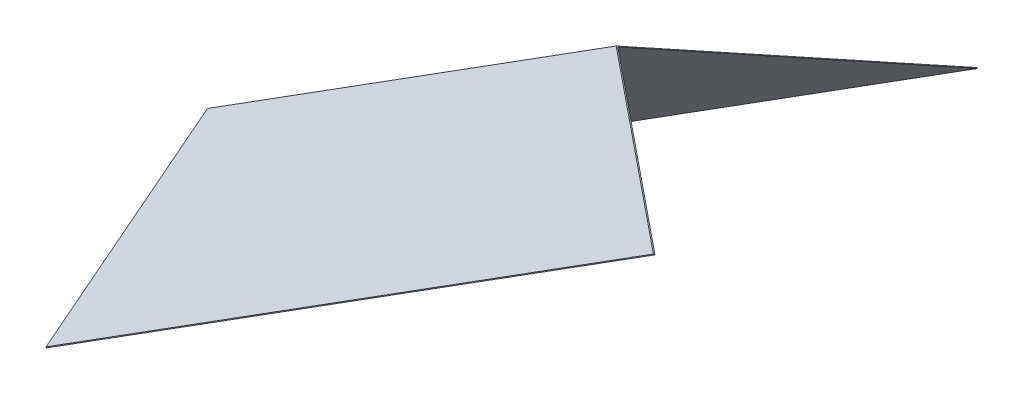
ISO-10303-21;
HEADER;
FILE_DESCRIPTION(('STEP AP214'),'2;1');
FILE_NAME('part.step','',(''),(''),'','','');
FILE_SCHEMA(('AUTOMOTIVE_DESIGN { 1 0 10303 214 1 1 1 1 }'));
ENDSEC;
DATA;
#1=APPLICATION_CONTEXT('core data for automotive mechanical design processes');
#2=APPLICATION_PROTOCOL_DEFINITION('international standard','automotive_design',2000,#1);
#3=PRODUCT_CONTEXT('',#1,'mechanical');
#4=PRODUCT('Part','Part','',(#3));
#5=PRODUCT_RELATED_PRODUCT_CATEGORY('part','',(#4));
#6=PRODUCT_DEFINITION_FORMATION('','',#4);
#7=PRODUCT_DEFINITION_CONTEXT('part definition',#1,'design');
#8=PRODUCT_DEFINITION('design','',#6,#7);
#9=PRODUCT_DEFINITION_SHAPE('','',#8);
#10=(LENGTH_UNIT() NAMED_UNIT(*) SI_UNIT(.MILLI.,.METRE.));
#11=(NAMED_UNIT(*) PLANE_ANGLE_UNIT() SI_UNIT($,.RADIAN.));
#12=(NAMED_UNIT(*) SI_UNIT($,.STERADIAN.) SOLID_ANGLE_UNIT());
#13=UNCERTAINTY_MEASURE_WITH_UNIT(LENGTH_MEASURE(1.E-05),#10,'distance_accuracy_value','');
#14=(GEOMETRIC_REPRESENTATION_CONTEXT(3) GLOBAL_UNCERTAINTY_ASSIGNED_CONTEXT((#13)) GLOBAL_UNIT_ASSIGNED_CONTEXT((#10,
#11,#12)) REPRESENTATION_CONTEXT('',''));
#15=CARTESIAN_POINT('',(0.,0.,0.));
#16=DIRECTION('',(0.,0.,1.));
#17=DIRECTION('',(1.,0.,0.));
#18=AXIS2_PLACEMENT_3D('',#15,#16,#17);
#19=CARTESIAN_POINT('',(-319.512763001159,500.225965029596,-389.338785232194));
#20=DIRECTION('',(-0.446530337817959,0.70609992000595,-0.54957580039133));
#21=DIRECTION('',(0.,0.614210049001455,0.789142582620929));
#22=AXIS2_PLACEMENT_3D('',#19,#20,#21);
#23=PLANE('',#22);
#24=DIRECTION('',(0.84517937784663,0.53448275862069,0.));
#25=VECTOR('',#24,1.);
#26=CARTESIAN_POINT('',(-89.3424576744258,1821.51710603682,1121.2545563695));
#27=LINE('',#26,#25);
#28=CARTESIAN_POINT('',(-86.1674576744245,1823.52494342981,1121.2545563695));
#29=VERTEX_POINT('',#28);
#30=CARTESIAN_POINT('',(1155.77580176923,2608.91710603682,1121.2545563695));
#31=VERTEX_POINT('',#30);
#32=EDGE_CURVE('E40',#29,#31,#27,.T.);
#33=ORIENTED_EDGE('',*,*,#32,.F.);
#34=DIRECTION('',(0.,0.614210049001455,0.789142582620929));
#35=VECTOR('',#34,1.);
#36=CARTESIAN_POINT('',(-86.1674576744258,592.12158959957,-460.863522729798));
#37=LINE('',#36,#35);
#38=CARTESIAN_POINT('',(-86.1674576744252,2080.52812973195,1451.4545563695));
#39=VERTEX_POINT('',#38);
#40=EDGE_CURVE('E92',#29,#39,#37,.T.);
#41=ORIENTED_EDGE('',*,*,#40,.T.);
#42=DIRECTION('',(-0.845179377846631,-0.534482758620689,0.));
#43=VECTOR('',#42,1.);
#44=CARTESIAN_POINT('',(749.375801769231,2608.91710603682,1451.4545563695));
#45=LINE('',#44,#43);
#46=CARTESIAN_POINT('',(749.375801769231,2608.91710603682,1451.4545563695));
#47=VERTEX_POINT('',#46);
#48=EDGE_CURVE('E84',#47,#39,#45,.T.);
#49=ORIENTED_EDGE('',*,*,#48,.F.);
#50=DIRECTION('',(-0.776114000116266,0.,0.630592625094465));
#51=VECTOR('',#50,1.);
#52=CARTESIAN_POINT('',(1155.77580176923,2608.91710603682,1121.2545563695));
#53=LINE('',#52,#51);
#54=EDGE_CURVE('E143',#31,#47,#53,.T.);
#55=ORIENTED_EDGE('',*,*,#54,.F.);
#56=EDGE_LOOP('',(#33,#41,#49,#55));
#57=FACE_BOUND('',#56,.T.);
#58=ADVANCED_FACE('F37',(#57),#23,.T.);
#59=CARTESIAN_POINT('',(-316.337763001159,500.225965029596,-389.338785232194));
#60=DIRECTION('',(-0.446530337817959,0.70609992000595,-0.54957580039133));
#61=DIRECTION('',(0.,0.614210049001455,0.789142582620929));
#62=AXIS2_PLACEMENT_3D('',#59,#60,#61);
#63=PLANE('',#62);
#64=DIRECTION('',(0.,0.614210049001455,0.789142582620929));
#65=VECTOR('',#64,1.);
#66=CARTESIAN_POINT('',(-86.1674576744258,590.871216862904,-459.890325342188));
#67=LINE('',#66,#65);
#68=CARTESIAN_POINT('',(-86.1674576744245,1821.51710603682,1121.2545563695));
#69=VERTEX_POINT('',#68);
#70=CARTESIAN_POINT('',(-86.1674576744253,2078.52029233896,1451.4545563695));
#71=VERTEX_POINT('',#70);
#72=EDGE_CURVE('E115',#69,#71,#67,.T.);
#73=ORIENTED_EDGE('',*,*,#72,.F.);
#74=DIRECTION('',(0.84517937784663,0.53448275862069,0.));
#75=VECTOR('',#74,1.);
#76=CARTESIAN_POINT('',(-86.1674576744258,1821.51710603682,1121.2545563695));
#77=LINE('',#76,#75);
#78=CARTESIAN_POINT('',(1158.95080176923,2608.91710603682,1121.2545563695));
#79=VERTEX_POINT('',#78);
#80=EDGE_CURVE('E47',#69,#79,#77,.T.);
#81=ORIENTED_EDGE('',*,*,#80,.T.);
#82=DIRECTION('',(-0.776114000116266,0.,0.630592625094465));
#83=VECTOR('',#82,1.);
#84=CARTESIAN_POINT('',(1158.95080176923,2608.91710603682,1121.2545563695));
#85=LINE('',#84,#83);
#86=CARTESIAN_POINT('',(752.550801769231,2608.91710603682,1451.4545563695));
#87=VERTEX_POINT('',#86);
#88=EDGE_CURVE('E55',#79,#87,#85,.T.);
#89=ORIENTED_EDGE('',*,*,#88,.T.);
#90=DIRECTION('',(-0.845179377846631,-0.534482758620689,0.));
#91=VECTOR('',#90,1.);
#92=CARTESIAN_POINT('',(752.550801769231,2608.91710603682,1451.4545563695));
#93=LINE('',#92,#91);
#94=EDGE_CURVE('E151',#87,#71,#93,.T.);
#95=ORIENTED_EDGE('',*,*,#94,.T.);
#96=EDGE_LOOP('',(#73,#81,#89,#95));
#97=FACE_BOUND('',#96,.T.);
#98=ADVANCED_FACE('F159',(#97),#63,.F.);
#99=CARTESIAN_POINT('',(-86.1674576744258,1821.51710603682,1121.2545563695));
#100=DIRECTION('',(0.,0.,1.));
#101=DIRECTION('',(0.,-1.,0.));
#102=AXIS2_PLACEMENT_3D('',#99,#100,#101);
#103=PLANE('',#102);
#104=DIRECTION('',(0.,-1.,0.));
#105=VECTOR('',#104,1.);
#106=CARTESIAN_POINT('',(-86.1674576744258,1821.51710603682,1121.2545563695));
#107=LINE('',#106,#105);
#108=EDGE_CURVE('E134',#29,#69,#107,.T.);
#109=ORIENTED_EDGE('',*,*,#108,.F.);
#110=ORIENTED_EDGE('',*,*,#32,.T.);
#111=DIRECTION('',(-1.,0.,0.));
#112=VECTOR('',#111,1.);
#113=CARTESIAN_POINT('',(1158.95080176923,2608.91710603682,1121.2545563695));
#114=LINE('',#113,#112);
#115=EDGE_CURVE('E141',#79,#31,#114,.T.);
#116=ORIENTED_EDGE('',*,*,#115,.F.);
#117=ORIENTED_EDGE('',*,*,#80,.F.);
#118=EDGE_LOOP('',(#109,#110,#116,#117));
#119=FACE_BOUND('',#118,.T.);
#120=ADVANCED_FACE('F178',(#119),#103,.F.);
#121=CARTESIAN_POINT('',(-1031.89324250003,1626.71560523187,1266.11476000002));
#122=DIRECTION('',(-0.446530337817959,0.706099920005952,0.549575800391326));
#123=DIRECTION('',(0.,-0.614210049001451,0.789142582620932));
#124=AXIS2_PLACEMENT_3D('',#121,#122,#123);
#125=PLANE('',#124);
#126=ORIENTED_EDGE('',*,*,#48,.T.);
#127=DIRECTION('',(0.,-0.614210049001451,0.789142582620932));
#128=VECTOR('',#127,1.);
#129=CARTESIAN_POINT('',(-86.1674576744257,1999.15961710856,1555.99755155501));
#130=LINE('',#129,#128);
#131=CARTESIAN_POINT('',(-86.1674576744258,1823.5249434298,1781.65455636951));
#132=VERTEX_POINT('',#131);
#133=EDGE_CURVE('E104',#39,#132,#130,.T.);
#134=ORIENTED_EDGE('',*,*,#133,.T.);
#135=DIRECTION('',(0.84517937784663,0.53448275862069,0.));
#136=VECTOR('',#135,1.);
#137=CARTESIAN_POINT('',(-89.3424576744258,1821.51710603682,1781.65455636951));
#138=LINE('',#137,#136);
#139=CARTESIAN_POINT('',(1155.77580176923,2608.91710603682,1781.6545563695));
#140=VERTEX_POINT('',#139);
#141=EDGE_CURVE('E113',#132,#140,#138,.T.);
#142=ORIENTED_EDGE('',*,*,#141,.T.);
#143=DIRECTION('',(-0.776114000116266,0.,-0.630592625094465));
#144=VECTOR('',#143,1.);
#145=CARTESIAN_POINT('',(1155.77580176923,2608.91710603682,1781.6545563695));
#146=LINE('',#145,#144);
#147=EDGE_CURVE('E132',#140,#47,#146,.T.);
#148=ORIENTED_EDGE('',*,*,#147,.T.);
#149=EDGE_LOOP('',(#126,#134,#142,#148));
#150=FACE_BOUND('',#149,.T.);
#151=ADVANCED_FACE('F111',(#150),#125,.T.);
#152=CARTESIAN_POINT('',(-1028.71824250003,1626.71560523187,1266.11476000002));
#153=DIRECTION('',(-0.446530337817959,0.706099920005952,0.549575800391326));
#154=DIRECTION('',(0.,-0.614210049001451,0.789142582620932));
#155=AXIS2_PLACEMENT_3D('',#152,#153,#154);
#156=PLANE('',#155);
#157=DIRECTION('',(0.,-0.614210049001451,0.789142582620932));
#158=VECTOR('',#157,1.);
#159=CARTESIAN_POINT('',(-86.1674576744258,1997.90924437189,1555.0243541674));
#160=LINE('',#159,#158);
#161=CARTESIAN_POINT('',(-86.1674576744257,1821.51710603682,1781.65455636951));
#162=VERTEX_POINT('',#161);
#163=EDGE_CURVE('E106',#71,#162,#160,.T.);
#164=ORIENTED_EDGE('',*,*,#163,.F.);
#165=ORIENTED_EDGE('',*,*,#94,.F.);
#166=DIRECTION('',(-0.776114000116266,0.,-0.630592625094465));
#167=VECTOR('',#166,1.);
#168=CARTESIAN_POINT('',(1158.95080176923,2608.91710603682,1781.6545563695));
#169=LINE('',#168,#167);
#170=CARTESIAN_POINT('',(1158.95080176923,2608.91710603682,1781.6545563695));
#171=VERTEX_POINT('',#170);
#172=EDGE_CURVE('E72',#171,#87,#169,.T.);
#173=ORIENTED_EDGE('',*,*,#172,.F.);
#174=DIRECTION('',(0.84517937784663,0.53448275862069,0.));
#175=VECTOR('',#174,1.);
#176=CARTESIAN_POINT('',(-86.1674576744258,1821.51710603682,1781.65455636951));
#177=LINE('',#176,#175);
#178=EDGE_CURVE('E120',#162,#171,#177,.T.);
#179=ORIENTED_EDGE('',*,*,#178,.F.);
#180=EDGE_LOOP('',(#164,#165,#173,#179));
#181=FACE_BOUND('',#180,.T.);
#182=ADVANCED_FACE('F161',(#181),#156,.F.);
#183=CARTESIAN_POINT('',(-86.1674576744258,1821.51710603682,1781.65455636951));
#184=DIRECTION('',(0.,0.,1.));
#185=DIRECTION('',(0.,-1.,0.));
#186=AXIS2_PLACEMENT_3D('',#183,#184,#185);
#187=PLANE('',#186);
#188=ORIENTED_EDGE('',*,*,#141,.F.);
#189=DIRECTION('',(0.,-1.,0.));
#190=VECTOR('',#189,1.);
#191=CARTESIAN_POINT('',(-86.1674576744258,1821.51710603682,1781.65455636951));
#192=LINE('',#191,#190);
#193=EDGE_CURVE('E12',#132,#162,#192,.T.);
#194=ORIENTED_EDGE('',*,*,#193,.T.);
#195=ORIENTED_EDGE('',*,*,#178,.T.);
#196=DIRECTION('',(-1.,0.,0.));
#197=VECTOR('',#196,1.);
#198=CARTESIAN_POINT('',(1158.95080176923,2608.91710603682,1781.6545563695));
#199=LINE('',#198,#197);
#200=EDGE_CURVE('E118',#171,#140,#199,.T.);
#201=ORIENTED_EDGE('',*,*,#200,.T.);
#202=EDGE_LOOP('',(#188,#194,#195,#201));
#203=FACE_BOUND('',#202,.T.);
#204=ADVANCED_FACE('F117',(#203),#187,.T.);
#205=CARTESIAN_POINT('',(1158.95080176923,2608.91710603682,1121.2545563695));
#206=DIRECTION('',(0.,-1.,0.));
#207=DIRECTION('',(0.,0.,-1.));
#208=AXIS2_PLACEMENT_3D('',#205,#206,#207);
#209=PLANE('',#208);
#210=ORIENTED_EDGE('',*,*,#54,.T.);
#211=ORIENTED_EDGE('',*,*,#147,.F.);
#212=ORIENTED_EDGE('',*,*,#200,.F.);
#213=ORIENTED_EDGE('',*,*,#172,.T.);
#214=ORIENTED_EDGE('',*,*,#88,.F.);
#215=ORIENTED_EDGE('',*,*,#115,.T.);
#216=EDGE_LOOP('',(#210,#211,#212,#213,#214,#215));
#217=FACE_BOUND('',#216,.T.);
#218=ADVANCED_FACE('F162',(#217),#209,.F.);
#219=CARTESIAN_POINT('',(-86.1674576744258,0.,0.));
#220=DIRECTION('',(-1.,0.,0.));
#221=DIRECTION('',(0.,0.,1.));
#222=AXIS2_PLACEMENT_3D('',#219,#220,#221);
#223=PLANE('',#222);
#224=ORIENTED_EDGE('',*,*,#108,.T.);
#225=ORIENTED_EDGE('',*,*,#72,.T.);
#226=ORIENTED_EDGE('',*,*,#163,.T.);
#227=ORIENTED_EDGE('',*,*,#193,.F.);
#228=ORIENTED_EDGE('',*,*,#133,.F.);
#229=ORIENTED_EDGE('',*,*,#40,.F.);
#230=EDGE_LOOP('',(#224,#225,#226,#227,#228,#229));
#231=FACE_BOUND('',#230,.T.);
#232=ADVANCED_FACE('F103',(#231),#223,.T.);
#233=CLOSED_SHELL('',(#58,#98,#120,#151,#182,#204,#218,#232));
#234=MANIFOLD_SOLID_BREP('B2',#233);
#235=ADVANCED_BREP_SHAPE_REPRESENTATION('',(#18,#234),#14);
#236=SHAPE_DEFINITION_REPRESENTATION(#9,#235);
ENDSEC;
END-ISO-10303-21;
